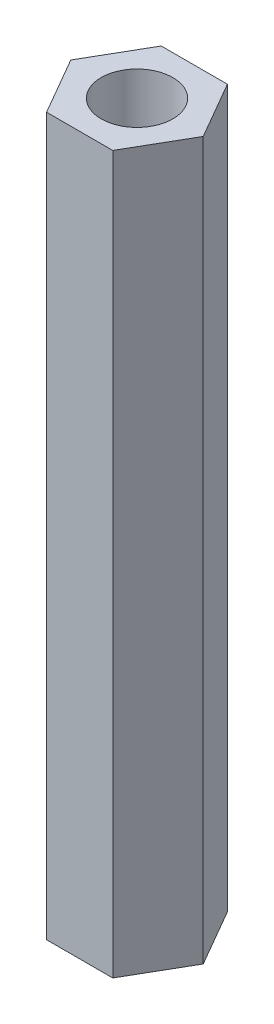
ISO-10303-21;
HEADER;
FILE_DESCRIPTION(('STEP AP214'),'2;1');
FILE_NAME('part.step','',(''),(''),'','','');
FILE_SCHEMA(('AUTOMOTIVE_DESIGN { 1 0 10303 214 1 1 1 1 }'));
ENDSEC;
DATA;
#1=APPLICATION_CONTEXT('core data for automotive mechanical design processes');
#2=APPLICATION_PROTOCOL_DEFINITION('international standard','automotive_design',2000,#1);
#3=PRODUCT_CONTEXT('',#1,'mechanical');
#4=PRODUCT('Part','Part','',(#3));
#5=PRODUCT_RELATED_PRODUCT_CATEGORY('part','',(#4));
#6=PRODUCT_DEFINITION_FORMATION('','',#4);
#7=PRODUCT_DEFINITION_CONTEXT('part definition',#1,'design');
#8=PRODUCT_DEFINITION('design','',#6,#7);
#9=PRODUCT_DEFINITION_SHAPE('','',#8);
#10=(LENGTH_UNIT() NAMED_UNIT(*) SI_UNIT(.MILLI.,.METRE.));
#11=(NAMED_UNIT(*) PLANE_ANGLE_UNIT() SI_UNIT($,.RADIAN.));
#12=(NAMED_UNIT(*) SI_UNIT($,.STERADIAN.) SOLID_ANGLE_UNIT());
#13=UNCERTAINTY_MEASURE_WITH_UNIT(LENGTH_MEASURE(1.E-05),#10,'distance_accuracy_value','');
#14=(GEOMETRIC_REPRESENTATION_CONTEXT(3) GLOBAL_UNCERTAINTY_ASSIGNED_CONTEXT((#13)) GLOBAL_UNIT_ASSIGNED_CONTEXT((#10,
#11,#12)) REPRESENTATION_CONTEXT('',''));
#15=CARTESIAN_POINT('',(0.,0.,0.));
#16=DIRECTION('',(0.,0.,1.));
#17=DIRECTION('',(1.,0.,0.));
#18=AXIS2_PLACEMENT_3D('',#15,#16,#17);
#19=CARTESIAN_POINT('',(0.,50.,0.));
#20=DIRECTION('',(0.,1.,0.));
#21=DIRECTION('',(0.,0.,1.));
#22=AXIS2_PLACEMENT_3D('',#19,#20,#21);
#23=PLANE('',#22);
#24=DIRECTION('',(0.5,0.,-0.866025403784439));
#25=VECTOR('',#24,1.);
#26=CARTESIAN_POINT('',(2.3094010767585,50.,4.));
#27=LINE('',#26,#25);
#28=CARTESIAN_POINT('',(2.3094010767585,50.,4.));
#29=VERTEX_POINT('',#28);
#30=CARTESIAN_POINT('',(4.61880215351701,50.,0.));
#31=VERTEX_POINT('',#30);
#32=EDGE_CURVE('E152',#29,#31,#27,.T.);
#33=ORIENTED_EDGE('',*,*,#32,.T.);
#34=DIRECTION('',(-0.5,0.,-0.866025403784438));
#35=VECTOR('',#34,1.);
#36=CARTESIAN_POINT('',(4.61880215351701,50.,0.));
#37=LINE('',#36,#35);
#38=CARTESIAN_POINT('',(2.3094010767585,50.,-4.));
#39=VERTEX_POINT('',#38);
#40=EDGE_CURVE('E100',#31,#39,#37,.T.);
#41=ORIENTED_EDGE('',*,*,#40,.T.);
#42=DIRECTION('',(-1.,0.,0.));
#43=VECTOR('',#42,1.);
#44=CARTESIAN_POINT('',(2.3094010767585,50.,-4.));
#45=LINE('',#44,#43);
#46=CARTESIAN_POINT('',(-2.3094010767585,50.,-4.));
#47=VERTEX_POINT('',#46);
#48=EDGE_CURVE('E113',#39,#47,#45,.T.);
#49=ORIENTED_EDGE('',*,*,#48,.T.);
#50=DIRECTION('',(-0.5,0.,0.866025403784439));
#51=VECTOR('',#50,1.);
#52=CARTESIAN_POINT('',(-2.3094010767585,50.,-4.));
#53=LINE('',#52,#51);
#54=CARTESIAN_POINT('',(-4.61880215351701,50.,0.));
#55=VERTEX_POINT('',#54);
#56=EDGE_CURVE('E107',#47,#55,#53,.T.);
#57=ORIENTED_EDGE('',*,*,#56,.T.);
#58=DIRECTION('',(0.5,0.,0.866025403784439));
#59=VECTOR('',#58,1.);
#60=CARTESIAN_POINT('',(-4.61880215351701,50.,0.));
#61=LINE('',#60,#59);
#62=CARTESIAN_POINT('',(-2.3094010767585,50.,4.));
#63=VERTEX_POINT('',#62);
#64=EDGE_CURVE('E111',#55,#63,#61,.T.);
#65=ORIENTED_EDGE('',*,*,#64,.T.);
#66=DIRECTION('',(1.,0.,0.));
#67=VECTOR('',#66,1.);
#68=CARTESIAN_POINT('',(-2.3094010767585,50.,4.));
#69=LINE('',#68,#67);
#70=EDGE_CURVE('E63',#63,#29,#69,.T.);
#71=ORIENTED_EDGE('',*,*,#70,.T.);
#72=EDGE_LOOP('',(#33,#41,#49,#57,#65,#71));
#73=FACE_BOUND('',#72,.T.);
#74=CARTESIAN_POINT('',(0.,50.,0.));
#75=DIRECTION('',(0.,1.,0.));
#76=DIRECTION('',(0.,0.,1.));
#77=AXIS2_PLACEMENT_3D('',#74,#75,#76);
#78=CIRCLE('',#77,2.5);
#79=CARTESIAN_POINT('',(0.,50.,2.5));
#80=VERTEX_POINT('',#79);
#81=EDGE_CURVE('E140',#80,#80,#78,.T.);
#82=ORIENTED_EDGE('',*,*,#81,.F.);
#83=EDGE_LOOP('',(#82));
#84=FACE_BOUND('',#83,.T.);
#85=ADVANCED_FACE('F45',(#73,#84),#23,.T.);
#86=CARTESIAN_POINT('',(0.,0.,0.));
#87=DIRECTION('',(0.,1.,0.));
#88=DIRECTION('',(0.,0.,1.));
#89=AXIS2_PLACEMENT_3D('',#86,#87,#88);
#90=PLANE('',#89);
#91=DIRECTION('',(0.5,0.,-0.866025403784439));
#92=VECTOR('',#91,1.);
#93=CARTESIAN_POINT('',(2.3094010767585,0.,4.));
#94=LINE('',#93,#92);
#95=CARTESIAN_POINT('',(2.3094010767585,0.,4.));
#96=VERTEX_POINT('',#95);
#97=CARTESIAN_POINT('',(4.61880215351701,0.,0.));
#98=VERTEX_POINT('',#97);
#99=EDGE_CURVE('E135',#96,#98,#94,.T.);
#100=ORIENTED_EDGE('',*,*,#99,.F.);
#101=DIRECTION('',(1.,0.,0.));
#102=VECTOR('',#101,1.);
#103=CARTESIAN_POINT('',(-2.3094010767585,0.,4.));
#104=LINE('',#103,#102);
#105=CARTESIAN_POINT('',(-2.3094010767585,0.,4.));
#106=VERTEX_POINT('',#105);
#107=EDGE_CURVE('E92',#106,#96,#104,.T.);
#108=ORIENTED_EDGE('',*,*,#107,.F.);
#109=DIRECTION('',(0.5,0.,0.866025403784439));
#110=VECTOR('',#109,1.);
#111=CARTESIAN_POINT('',(-4.61880215351701,0.,0.));
#112=LINE('',#111,#110);
#113=CARTESIAN_POINT('',(-4.61880215351701,0.,0.));
#114=VERTEX_POINT('',#113);
#115=EDGE_CURVE('E86',#114,#106,#112,.T.);
#116=ORIENTED_EDGE('',*,*,#115,.F.);
#117=DIRECTION('',(-0.5,0.,0.866025403784439));
#118=VECTOR('',#117,1.);
#119=CARTESIAN_POINT('',(-2.3094010767585,0.,-4.));
#120=LINE('',#119,#118);
#121=CARTESIAN_POINT('',(-2.3094010767585,0.,-4.));
#122=VERTEX_POINT('',#121);
#123=EDGE_CURVE('E122',#122,#114,#120,.T.);
#124=ORIENTED_EDGE('',*,*,#123,.F.);
#125=DIRECTION('',(-1.,0.,0.));
#126=VECTOR('',#125,1.);
#127=CARTESIAN_POINT('',(2.3094010767585,0.,-4.));
#128=LINE('',#127,#126);
#129=CARTESIAN_POINT('',(2.3094010767585,0.,-4.));
#130=VERTEX_POINT('',#129);
#131=EDGE_CURVE('E143',#130,#122,#128,.T.);
#132=ORIENTED_EDGE('',*,*,#131,.F.);
#133=DIRECTION('',(-0.5,0.,-0.866025403784438));
#134=VECTOR('',#133,1.);
#135=CARTESIAN_POINT('',(4.61880215351701,0.,0.));
#136=LINE('',#135,#134);
#137=EDGE_CURVE('E139',#98,#130,#136,.T.);
#138=ORIENTED_EDGE('',*,*,#137,.F.);
#139=EDGE_LOOP('',(#100,#108,#116,#124,#132,#138));
#140=FACE_BOUND('',#139,.T.);
#141=CARTESIAN_POINT('',(0.,0.,0.));
#142=DIRECTION('',(0.,1.,0.));
#143=DIRECTION('',(0.,0.,1.));
#144=AXIS2_PLACEMENT_3D('',#141,#142,#143);
#145=CIRCLE('',#144,2.5);
#146=CARTESIAN_POINT('',(0.,0.,2.5));
#147=VERTEX_POINT('',#146);
#148=EDGE_CURVE('E249',#147,#147,#145,.T.);
#149=ORIENTED_EDGE('',*,*,#148,.T.);
#150=EDGE_LOOP('',(#149));
#151=FACE_BOUND('',#150,.T.);
#152=ADVANCED_FACE('F165',(#140,#151),#90,.F.);
#153=CARTESIAN_POINT('',(2.3094010767585,50.,4.));
#154=DIRECTION('',(-0.866025403784439,0.,-0.5));
#155=DIRECTION('',(-0.5,0.,0.866025403784439));
#156=AXIS2_PLACEMENT_3D('',#153,#154,#155);
#157=PLANE('',#156);
#158=ORIENTED_EDGE('',*,*,#99,.T.);
#159=DIRECTION('',(0.,-1.,0.));
#160=VECTOR('',#159,1.);
#161=CARTESIAN_POINT('',(4.61880215351701,50.,0.));
#162=LINE('',#161,#160);
#163=EDGE_CURVE('E11',#31,#98,#162,.T.);
#164=ORIENTED_EDGE('',*,*,#163,.F.);
#165=ORIENTED_EDGE('',*,*,#32,.F.);
#166=DIRECTION('',(0.,-1.,0.));
#167=VECTOR('',#166,1.);
#168=CARTESIAN_POINT('',(2.3094010767585,50.,4.));
#169=LINE('',#168,#167);
#170=EDGE_CURVE('E131',#29,#96,#169,.T.);
#171=ORIENTED_EDGE('',*,*,#170,.T.);
#172=EDGE_LOOP('',(#158,#164,#165,#171));
#173=FACE_BOUND('',#172,.T.);
#174=ADVANCED_FACE('F47',(#173),#157,.F.);
#175=CARTESIAN_POINT('',(4.61880215351701,50.,0.));
#176=DIRECTION('',(-0.866025403784438,0.,0.5));
#177=DIRECTION('',(0.5,0.,0.866025403784438));
#178=AXIS2_PLACEMENT_3D('',#175,#176,#177);
#179=PLANE('',#178);
#180=ORIENTED_EDGE('',*,*,#137,.T.);
#181=DIRECTION('',(0.,-1.,0.));
#182=VECTOR('',#181,1.);
#183=CARTESIAN_POINT('',(2.3094010767585,50.,-4.));
#184=LINE('',#183,#182);
#185=EDGE_CURVE('E55',#39,#130,#184,.T.);
#186=ORIENTED_EDGE('',*,*,#185,.F.);
#187=ORIENTED_EDGE('',*,*,#40,.F.);
#188=ORIENTED_EDGE('',*,*,#163,.T.);
#189=EDGE_LOOP('',(#180,#186,#187,#188));
#190=FACE_BOUND('',#189,.T.);
#191=ADVANCED_FACE('F190',(#190),#179,.F.);
#192=CARTESIAN_POINT('',(2.3094010767585,50.,-4.));
#193=DIRECTION('',(0.,0.,1.));
#194=DIRECTION('',(1.,0.,0.));
#195=AXIS2_PLACEMENT_3D('',#192,#193,#194);
#196=PLANE('',#195);
#197=ORIENTED_EDGE('',*,*,#131,.T.);
#198=DIRECTION('',(0.,-1.,0.));
#199=VECTOR('',#198,1.);
#200=CARTESIAN_POINT('',(-2.3094010767585,50.,-4.));
#201=LINE('',#200,#199);
#202=EDGE_CURVE('E124',#47,#122,#201,.T.);
#203=ORIENTED_EDGE('',*,*,#202,.F.);
#204=ORIENTED_EDGE('',*,*,#48,.F.);
#205=ORIENTED_EDGE('',*,*,#185,.T.);
#206=EDGE_LOOP('',(#197,#203,#204,#205));
#207=FACE_BOUND('',#206,.T.);
#208=ADVANCED_FACE('F162',(#207),#196,.F.);
#209=CARTESIAN_POINT('',(-2.3094010767585,50.,-4.));
#210=DIRECTION('',(0.866025403784439,0.,0.5));
#211=DIRECTION('',(0.5,0.,-0.866025403784439));
#212=AXIS2_PLACEMENT_3D('',#209,#210,#211);
#213=PLANE('',#212);
#214=ORIENTED_EDGE('',*,*,#123,.T.);
#215=DIRECTION('',(0.,-1.,0.));
#216=VECTOR('',#215,1.);
#217=CARTESIAN_POINT('',(-4.61880215351701,50.,0.));
#218=LINE('',#217,#216);
#219=EDGE_CURVE('E119',#55,#114,#218,.T.);
#220=ORIENTED_EDGE('',*,*,#219,.F.);
#221=ORIENTED_EDGE('',*,*,#56,.F.);
#222=ORIENTED_EDGE('',*,*,#202,.T.);
#223=EDGE_LOOP('',(#214,#220,#221,#222));
#224=FACE_BOUND('',#223,.T.);
#225=ADVANCED_FACE('F120',(#224),#213,.F.);
#226=CARTESIAN_POINT('',(-4.61880215351701,50.,0.));
#227=DIRECTION('',(0.866025403784439,0.,-0.5));
#228=DIRECTION('',(-0.5,0.,-0.866025403784439));
#229=AXIS2_PLACEMENT_3D('',#226,#227,#228);
#230=PLANE('',#229);
#231=ORIENTED_EDGE('',*,*,#115,.T.);
#232=DIRECTION('',(0.,-1.,0.));
#233=VECTOR('',#232,1.);
#234=CARTESIAN_POINT('',(-2.3094010767585,50.,4.));
#235=LINE('',#234,#233);
#236=EDGE_CURVE('E125',#63,#106,#235,.T.);
#237=ORIENTED_EDGE('',*,*,#236,.F.);
#238=ORIENTED_EDGE('',*,*,#64,.F.);
#239=ORIENTED_EDGE('',*,*,#219,.T.);
#240=EDGE_LOOP('',(#231,#237,#238,#239));
#241=FACE_BOUND('',#240,.T.);
#242=ADVANCED_FACE('F127',(#241),#230,.F.);
#243=CARTESIAN_POINT('',(-2.3094010767585,50.,4.));
#244=DIRECTION('',(0.,0.,-1.));
#245=DIRECTION('',(-1.,0.,0.));
#246=AXIS2_PLACEMENT_3D('',#243,#244,#245);
#247=PLANE('',#246);
#248=ORIENTED_EDGE('',*,*,#107,.T.);
#249=ORIENTED_EDGE('',*,*,#170,.F.);
#250=ORIENTED_EDGE('',*,*,#70,.F.);
#251=ORIENTED_EDGE('',*,*,#236,.T.);
#252=EDGE_LOOP('',(#248,#249,#250,#251));
#253=FACE_BOUND('',#252,.T.);
#254=ADVANCED_FACE('F170',(#253),#247,.F.);
#255=CARTESIAN_POINT('',(0.,50.,0.));
#256=DIRECTION('',(0.,-1.,0.));
#257=DIRECTION('',(0.,0.,-1.));
#258=AXIS2_PLACEMENT_3D('',#255,#256,#257);
#259=CYLINDRICAL_SURFACE('',#258,2.5);
#260=ORIENTED_EDGE('',*,*,#81,.T.);
#261=EDGE_LOOP('',(#260));
#262=FACE_BOUND('',#261,.T.);
#263=ORIENTED_EDGE('',*,*,#148,.F.);
#264=EDGE_LOOP('',(#263));
#265=FACE_BOUND('',#264,.T.);
#266=ADVANCED_FACE('F172',(#262,#265),#259,.F.);
#267=CLOSED_SHELL('',(#85,#152,#174,#191,#208,#225,#242,#254,#266));
#268=MANIFOLD_SOLID_BREP('B2',#267);
#269=ADVANCED_BREP_SHAPE_REPRESENTATION('',(#18,#268),#14);
#270=SHAPE_DEFINITION_REPRESENTATION(#9,#269);
ENDSEC;
END-ISO-10303-21;
